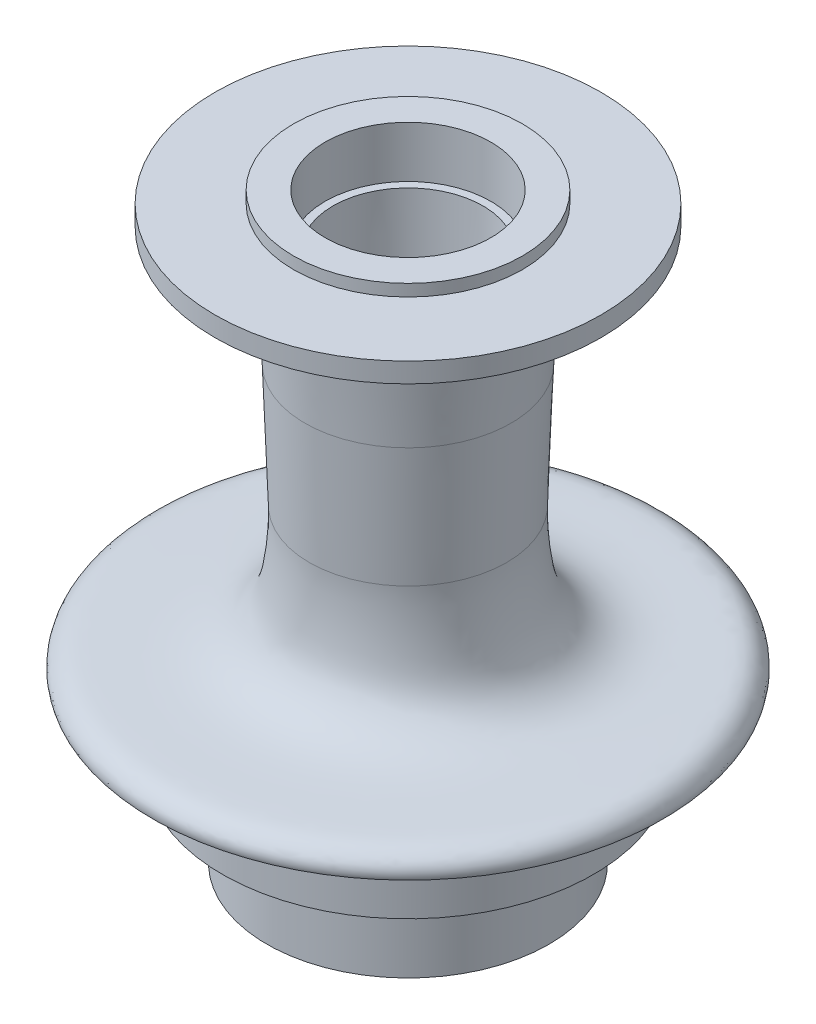
ISO-10303-21;
HEADER;
FILE_DESCRIPTION(('STEP AP214'),'2;1');
FILE_NAME('part.step','',(''),(''),'','','');
FILE_SCHEMA(('AUTOMOTIVE_DESIGN { 1 0 10303 214 1 1 1 1 }'));
ENDSEC;
DATA;
#1=APPLICATION_CONTEXT('core data for automotive mechanical design processes');
#2=APPLICATION_PROTOCOL_DEFINITION('international standard','automotive_design',2000,#1);
#3=PRODUCT_CONTEXT('',#1,'mechanical');
#4=PRODUCT('Part','Part','',(#3));
#5=PRODUCT_RELATED_PRODUCT_CATEGORY('part','',(#4));
#6=PRODUCT_DEFINITION_FORMATION('','',#4);
#7=PRODUCT_DEFINITION_CONTEXT('part definition',#1,'design');
#8=PRODUCT_DEFINITION('design','',#6,#7);
#9=PRODUCT_DEFINITION_SHAPE('','',#8);
#10=(LENGTH_UNIT() NAMED_UNIT(*) SI_UNIT(.MILLI.,.METRE.));
#11=(NAMED_UNIT(*) PLANE_ANGLE_UNIT() SI_UNIT($,.RADIAN.));
#12=(NAMED_UNIT(*) SI_UNIT($,.STERADIAN.) SOLID_ANGLE_UNIT());
#13=UNCERTAINTY_MEASURE_WITH_UNIT(LENGTH_MEASURE(1.E-05),#10,'distance_accuracy_value','');
#14=(GEOMETRIC_REPRESENTATION_CONTEXT(3) GLOBAL_UNCERTAINTY_ASSIGNED_CONTEXT((#13)) GLOBAL_UNIT_ASSIGNED_CONTEXT((#10,
#11,#12)) REPRESENTATION_CONTEXT('',''));
#15=CARTESIAN_POINT('',(0.,0.,0.));
#16=DIRECTION('',(0.,0.,1.));
#17=DIRECTION('',(1.,0.,0.));
#18=AXIS2_PLACEMENT_3D('',#15,#16,#17);
#19=CARTESIAN_POINT('',(1.20729060743416E-13,-59.79986625963,0.));
#20=DIRECTION('',(0.,-1.,0.));
#21=DIRECTION('',(1.,0.,0.));
#22=AXIS2_PLACEMENT_3D('',#19,#20,#21);
#23=CONICAL_SURFACE('',#22,33.4343404918245,0.100930263307096);
#24=CARTESIAN_POINT('',(1.20729060743416E-13,-59.79986625963,0.));
#25=DIRECTION('',(0.,1.,0.));
#26=DIRECTION('',(-1.,0.,0.));
#27=AXIS2_PLACEMENT_3D('',#24,#25,#26);
#28=CIRCLE('',#27,33.4343404918245);
#29=CARTESIAN_POINT('',(9.28218533115908,-59.79986625963,-32.1200273910418));
#30=VERTEX_POINT('',#29);
#31=CARTESIAN_POINT('',(7.1205944149857,-59.79986625963,32.6672964798211));
#32=VERTEX_POINT('',#31);
#33=EDGE_CURVE('E209',#30,#32,#28,.T.);
#34=ORIENTED_EDGE('',*,*,#33,.F.);
#35=CARTESIAN_POINT('',(-19.1687823911382,-99.0073871203538,-32.1200273910418));
#36=CARTESIAN_POINT('',(-18.9027250081955,-97.6613157246267,-32.1200273910418));
#37=CARTESIAN_POINT('',(-18.6328175276927,-96.3159964492487,-32.1200273910418));
#38=CARTESIAN_POINT('',(-18.0840719761221,-93.6271375209407,-32.1200273910418));
#39=CARTESIAN_POINT('',(-17.8052336223954,-92.2835979257411,-32.1200273910418));
#40=CARTESIAN_POINT('',(-17.2368188773369,-89.5958515033702,-32.1200273910418));
#41=CARTESIAN_POINT('',(-16.9472212486299,-88.2516491570557,-32.1200273910418));
#42=CARTESIAN_POINT('',(-16.356234747528,-85.5658523065461,-32.1200273910418));
#43=CARTESIAN_POINT('',(-16.0548460232311,-84.2242577698185,-32.1200273910418));
#44=CARTESIAN_POINT('',(-15.4186602128928,-81.4590478717845,-32.1200273910418));
#45=CARTESIAN_POINT('',(-15.0829573193228,-80.0356401421744,-32.1200273910418));
#46=CARTESIAN_POINT('',(-14.3927360711123,-77.1934052528158,-32.1200273910418));
#47=CARTESIAN_POINT('',(-14.0382180111173,-75.7745780217056,-32.1200273910418));
#48=CARTESIAN_POINT('',(-13.3065457434716,-72.9449267742672,-32.1200273910418));
#49=CARTESIAN_POINT('',(-12.9294252331908,-71.5340941151127,-32.1200273910418));
#50=CARTESIAN_POINT('',(-12.3417074775923,-69.4240344115508,-32.1200273910418));
#51=CARTESIAN_POINT('',(-12.1421348667845,-68.7217331088597,-32.1200273910418));
#52=CARTESIAN_POINT('',(-11.7345504679368,-67.3195868304282,-32.1200273910418));
#53=CARTESIAN_POINT('',(-11.5265387934885,-66.6197418217633,-32.1200273910418));
#54=CARTESIAN_POINT('',(-11.1038760461954,-65.2332247969363,-32.1200273910418));
#55=CARTESIAN_POINT('',(-10.8893664510695,-64.5465097500048,-32.1200273910418));
#56=CARTESIAN_POINT('',(-10.4492594300789,-63.1765911771564,-32.1200273910418));
#57=CARTESIAN_POINT('',(-10.223661432871,-62.4933878341918,-32.1200273910418));
#58=CARTESIAN_POINT('',(-9.758632036217,-61.129491669726,-32.1200273910418));
#59=CARTESIAN_POINT('',(-9.51916265908692,-60.4488117497555,-32.1200273910418));
#60=CARTESIAN_POINT('',(-9.02420985737996,-59.0933884154323,-32.1200273910418));
#61=CARTESIAN_POINT('',(-8.76872903467408,-58.4186440567639,-32.1200273910418));
#62=CARTESIAN_POINT('',(-8.24223957389128,-57.0882102779597,-32.1200273910418));
#63=CARTESIAN_POINT('',(-7.97156113200226,-56.4323907665077,-32.1200273910418));
#64=CARTESIAN_POINT('',(-7.40539573153379,-55.1308598800939,-32.1200273910418));
#65=CARTESIAN_POINT('',(-7.10989224015013,-54.4851555866366,-32.1200273910418));
#66=CARTESIAN_POINT('',(-6.64269896361589,-53.5300752277546,-32.1200273910418));
#67=CARTESIAN_POINT('',(-6.48336284758461,-53.2146548038314,-32.1200273910418));
#68=CARTESIAN_POINT('',(-6.15506884365628,-52.5888774611227,-32.1200273910418));
#69=CARTESIAN_POINT('',(-5.98611204955203,-52.2785199718639,-32.1200273910418));
#70=CARTESIAN_POINT('',(-5.63693512837244,-51.6646764551865,-32.1200273910418));
#71=CARTESIAN_POINT('',(-5.45672894094535,-51.3611825343324,-32.1200273910418));
#72=CARTESIAN_POINT('',(-5.0824824124241,-50.7628973650559,-32.1200273910418));
#73=CARTESIAN_POINT('',(-4.88844692580794,-50.4681031136849,-32.1200273910418));
#74=CARTESIAN_POINT('',(-4.54787480068365,-49.9826723964043,-32.1200273910418));
#75=CARTESIAN_POINT('',(-4.40593803971509,-49.7888155964191,-32.1200273910418));
#76=CARTESIAN_POINT('',(-4.11267050876102,-49.4081396382554,-32.1200273910418));
#77=CARTESIAN_POINT('',(-3.96133520393455,-49.2213239484054,-32.1200273910418));
#78=CARTESIAN_POINT('',(-3.64817680228393,-48.8576034363628,-32.1200273910418));
#79=CARTESIAN_POINT('',(-3.48638686350959,-48.6806703065779,-32.1200273910418));
#80=CARTESIAN_POINT('',(-3.15008856271922,-48.3394408593386,-32.1200273910418));
#81=CARTESIAN_POINT('',(-2.97558956412164,-48.1751354182251,-32.1200273910418));
#82=CARTESIAN_POINT('',(-2.60351405682939,-47.8567867774717,-32.1200273910418));
#83=CARTESIAN_POINT('',(-2.40525553295735,-47.7035276549091,-32.1200273910418));
#84=CARTESIAN_POINT('',(-1.99024247437136,-47.4238261055312,-32.1200273910418));
#85=CARTESIAN_POINT('',(-1.77349578322511,-47.297372385153,-32.1200273910418));
#86=CARTESIAN_POINT('',(-1.36272727752306,-47.102213483968,-32.1200273910418));
#87=CARTESIAN_POINT('',(-1.17176809441563,-47.0271827688717,-32.1200273910418));
#88=CARTESIAN_POINT('',(-0.780125312899384,-46.9097976345264,-32.1200273910418));
#89=CARTESIAN_POINT('',(-0.579460180072017,-46.8673835744369,-32.1200273910418));
#90=CARTESIAN_POINT('',(-0.172173437027227,-46.8202778382634,-32.1200273910418));
#91=CARTESIAN_POINT('',(0.0344798117402685,-46.8158495800599,-32.1200273910418));
#92=CARTESIAN_POINT('',(0.444956821306117,-46.8460599269466,-32.1200273910418));
#93=CARTESIAN_POINT('',(0.64877809415581,-46.8807309249903,-32.1200273910418));
#94=CARTESIAN_POINT('',(1.07505081347502,-46.9917881427812,-32.1200273910418));
#95=CARTESIAN_POINT('',(1.29612521015382,-47.0733269165819,-32.1200273910418));
#96=CARTESIAN_POINT('',(1.72231608842142,-47.2707438090281,-32.1200273910418));
#97=CARTESIAN_POINT('',(1.92739986863018,-47.386690080767,-32.1200273910418));
#98=CARTESIAN_POINT('',(2.29131190464725,-47.6238195280482,-32.1200273910418));
#99=CARTESIAN_POINT('',(2.45244421779674,-47.7415569471767,-32.1200273910418));
#100=CARTESIAN_POINT('',(2.76400766573567,-47.9905441841909,-32.1200273910418));
#101=CARTESIAN_POINT('',(2.91443027474174,-48.1218045684668,-32.1200273910418));
#102=CARTESIAN_POINT('',(3.20599588677176,-48.3948441141838,-32.1200273910418));
#103=CARTESIAN_POINT('',(3.34711530438789,-48.536648206932,-32.1200273910418));
#104=CARTESIAN_POINT('',(3.62083182674354,-48.8281051849082,-32.1200273910418));
#105=CARTESIAN_POINT('',(3.75343177084105,-48.977755424669,-32.1200273910418));
#106=CARTESIAN_POINT('',(4.08440067355935,-49.3698841661066,-32.1200273910418));
#107=CARTESIAN_POINT('',(4.27741661120751,-49.616872092367,-32.1200273910418));
#108=CARTESIAN_POINT('',(4.64885138687969,-50.1216610311098,-32.1200273910418));
#109=CARTESIAN_POINT('',(4.82726171350738,-50.3794682179947,-32.1200273910418));
#110=CARTESIAN_POINT('',(5.17231591239864,-50.9034969440891,-32.1200273910418));
#111=CARTESIAN_POINT('',(5.33893683401745,-51.1697335101978,-32.1200273910418));
#112=CARTESIAN_POINT('',(5.66206315469713,-51.7082844682541,-32.1200273910418));
#113=CARTESIAN_POINT('',(5.81856729316581,-51.9805996119516,-32.1200273910418));
#114=CARTESIAN_POINT('',(6.12387490311396,-52.5315581066756,-32.1200273910418));
#115=CARTESIAN_POINT('',(6.27262850010436,-52.8102289825684,-32.1200273910418));
#116=CARTESIAN_POINT('',(6.56269939011301,-53.3714162849132,-32.1200273910418));
#117=CARTESIAN_POINT('',(6.70401635294637,-53.6539328814145,-32.1200273910418));
#118=CARTESIAN_POINT('',(6.98001477395537,-54.2217180763887,-32.1200273910418));
#119=CARTESIAN_POINT('',(7.1147047766222,-54.5069825321598,-32.1200273910418));
#120=CARTESIAN_POINT('',(7.37843085595563,-55.0800928401456,-32.1200273910418));
#121=CARTESIAN_POINT('',(7.50746712389514,-55.3679386046339,-32.1200273910418));
#122=CARTESIAN_POINT('',(7.92518583577531,-56.3216134156553,-32.1200273910418));
#123=CARTESIAN_POINT('',(8.2032204053256,-56.992115745607,-32.1200273910418));
#124=CARTESIAN_POINT('',(8.73897037937569,-58.3412260562856,-32.1200273910418));
#125=CARTESIAN_POINT('',(8.99668233307952,-59.0198353911587,-32.1200273910418));
#126=CARTESIAN_POINT('',(9.49587501542453,-60.3833862341983,-32.1200273910418));
#127=CARTESIAN_POINT('',(9.73734703512209,-61.0683309193559,-32.1200273910418));
#128=CARTESIAN_POINT('',(10.2068193839069,-62.4428262988265,-32.1200273910418));
#129=CARTESIAN_POINT('',(10.4348192521454,-63.1323771498078,-32.1200273910418));
#130=CARTESIAN_POINT('',(10.880007027108,-64.516680592312,-32.1200273910418));
#131=CARTESIAN_POINT('',(11.0971691670768,-65.2114414471084,-32.1200273910418));
#132=CARTESIAN_POINT('',(11.5217822790494,-66.603924765007,-32.1200273910418));
#133=CARTESIAN_POINT('',(11.7292331192117,-67.3016472681767,-32.1200273910418));
#134=CARTESIAN_POINT('',(12.3389162901079,-69.3979965434657,-32.1200273910418));
#135=CARTESIAN_POINT('',(12.7286261650622,-70.8002685531618,-32.1200273910418));
#136=CARTESIAN_POINT('',(13.4818367598874,-73.6100627086698,-32.1200273910418));
#137=CARTESIAN_POINT('',(13.8453667347833,-75.0175770859155,-32.1200273910418));
#138=CARTESIAN_POINT('',(14.5518148256759,-77.8378647027661,-32.1200273910418));
#139=CARTESIAN_POINT('',(14.8947314065071,-79.2506383257491,-32.1200273910418));
#140=CARTESIAN_POINT('',(15.5632328107012,-82.0786033501802,-32.1200273910418));
#141=CARTESIAN_POINT('',(15.888836510607,-83.4937903068163,-32.1200273910418));
#142=CARTESIAN_POINT('',(16.5258521682623,-86.3273553854903,-32.1200273910418));
#143=CARTESIAN_POINT('',(16.8372640583749,-87.7457335227031,-32.1200273910418));
#144=CARTESIAN_POINT('',(17.3188362693838,-89.9846756612072,-32.1200273910418));
#145=CARTESIAN_POINT('',(17.4930352624526,-90.8043747256982,-32.1200273910418));
#146=CARTESIAN_POINT('',(17.837755509206,-92.4446932181736,-32.1200273910418));
#147=CARTESIAN_POINT('',(18.0082761259929,-93.2653127800693,-32.1200273910418));
#148=CARTESIAN_POINT('',(18.3456221573824,-94.9058829923058,-32.1200273910418));
#149=CARTESIAN_POINT('',(18.5124532638145,-95.7258324734838,-32.1200273910418));
#150=CARTESIAN_POINT('',(18.8429336902099,-97.3662218198634,-32.1200273910418));
#151=CARTESIAN_POINT('',(19.006583567102,-98.1866615728339,-32.1200273910418));
#152=CARTESIAN_POINT('',(19.1687823911384,-99.0073871203538,-32.1200273910418));
#153=B_SPLINE_CURVE_WITH_KNOTS('',3,(#35,#36,#37,#38,#39,#40,#41,#42,#43,#44,#45,#46,#47,#48,
#49,#50,#51,#52,#53,#54,#55,#56,#57,#58,#59,#60,#61,#62,#63,#64,#65,#66,#67,#68,#69,#70,#71,#72,
#73,#74,#75,#76,#77,#78,#79,#80,#81,#82,#83,#84,#85,#86,#87,#88,#89,#90,#91,#92,#93,#94,#95,#96,
#97,#98,#99,#100,#101,#102,#103,#104,#105,#106,#107,#108,#109,#110,#111,#112,#113,#114,#115,
#116,#117,#118,#119,#120,#121,#122,#123,#124,#125,#126,#127,#128,#129,#130,#131,#132,#133,#134,
#135,#136,#137,#138,#139,#140,#141,#142,#143,#144,#145,#146,#147,#148,#149,#150,#151,#152),
.UNSPECIFIED.,.F.,.F.,(4,2,2,2,2,2,2,2,2,2,2,2,2,2,2,2,2,2,2,2,2,2,2,2,2,2,2,2,2,2,2,2,2,2,2,2,
2,2,2,2,2,2,2,2,2,2,2,2,2,2,2,2,2,2,2,2,2,2,4),(0.,4.11634696256925,8.23282433500074,
12.3579106800695,16.4829452300432,20.8702137043421,25.2574134943103,29.6382278229822,
31.828507282608,34.0187572704136,36.1769946905972,38.3353434333594,40.4999097161711,
42.6641251629401,44.7922314415617,46.9217663898789,47.981781164926,49.0416756646163,
50.1002819130714,51.1585183735992,51.8790835935287,52.599999232162,53.3187310877087,
54.0369386711481,54.7871653785026,55.5370753718261,56.1502478632308,56.7622964608357,
57.3785859933136,57.9953864847081,58.6983844322072,59.4027842535299,60.0006222400047,
60.5989309517598,61.1987023814176,61.798272871968,62.7379034793456,63.6780778138633,
64.6200347260975,65.5621087846332,66.5096415086385,67.4572162674514,68.4035354069045,
69.3498225064404,71.5269100428149,73.7043664578942,75.8829814108125,78.0616708456281,
80.245314868478,82.4289885281047,86.7948776887979,91.1558098985505,95.5170664837689,
99.8734660708395,104.229886417943,106.743893118169,109.258331671294,111.768574002477,
114.278372841211),.UNSPECIFIED.);
#154=CARTESIAN_POINT('',(0.,-46.8221221149622,-32.1200273910416));
#155=VERTEX_POINT('',#154);
#156=EDGE_CURVE('E94',#155,#30,#153,.T.);
#157=ORIENTED_EDGE('',*,*,#156,.F.);
#158=DIRECTION('',(0.,-0.994910863393885,-0.100758989181283));
#159=VECTOR('',#158,1.);
#160=CARTESIAN_POINT('',(0.,270.336321449422,0.));
#161=LINE('',#160,#159);
#162=CARTESIAN_POINT('',(0.,-39.3216123069004,-31.3604178477035));
#163=VERTEX_POINT('',#162);
#164=EDGE_CURVE('E108',#155,#163,#161,.F.);
#165=ORIENTED_EDGE('',*,*,#164,.T.);
#166=CARTESIAN_POINT('',(1.18221197927883E-13,-39.3216123069003,0.));
#167=DIRECTION('',(0.,1.,0.));
#168=DIRECTION('',(-1.,0.,0.));
#169=AXIS2_PLACEMENT_3D('',#166,#167,#168);
#170=CIRCLE('',#169,31.3604178477035);
#171=CARTESIAN_POINT('',(0.,-39.3216123069004,31.3604178477035));
#172=VERTEX_POINT('',#171);
#173=EDGE_CURVE('E107',#163,#172,#170,.T.);
#174=ORIENTED_EDGE('',*,*,#173,.T.);
#175=DIRECTION('',(0.,0.994910863393885,-0.100758989181283));
#176=VECTOR('',#175,1.);
#177=CARTESIAN_POINT('',(0.,270.336321449422,0.));
#178=LINE('',#177,#176);
#179=CARTESIAN_POINT('',(0.,-52.2259472828284,32.6672964798211));
#180=VERTEX_POINT('',#179);
#181=EDGE_CURVE('E98',#172,#180,#178,.F.);
#182=ORIENTED_EDGE('',*,*,#181,.T.);
#183=CARTESIAN_POINT('',(18.2204862355415,-99.0073871203538,32.6672964798211));
#184=CARTESIAN_POINT('',(17.9365645439715,-97.6421130060116,32.6672964798211));
#185=CARTESIAN_POINT('',(17.6479204730695,-96.2778050145036,32.6672964798211));
#186=CARTESIAN_POINT('',(17.0594264957987,-93.5515128990658,32.6672964798211));
#187=CARTESIAN_POINT('',(16.7595758246666,-92.1895289403893,32.6672964798211));
#188=CARTESIAN_POINT('',(16.1461981416955,-89.4651420010152,32.6672964798211));
#189=CARTESIAN_POINT('',(15.8326395301969,-88.1027461140478,32.6672964798211));
#190=CARTESIAN_POINT('',(15.1901636502384,-85.3816159791651,32.6672964798211));
#191=CARTESIAN_POINT('',(14.8612468812954,-84.0228816136789,32.6672964798211));
#192=CARTESIAN_POINT('',(14.1743772873109,-81.2676506623893,32.6672964798211));
#193=CARTESIAN_POINT('',(13.8158385071233,-79.871299708964,32.6672964798211));
#194=CARTESIAN_POINT('',(13.0744310584008,-77.0848865107695,32.6672964798211));
#195=CARTESIAN_POINT('',(12.6915602837275,-75.6948248215748,32.6672964798211));
#196=CARTESIAN_POINT('',(12.0941063672266,-73.61716723586,32.6672964798211));
#197=CARTESIAN_POINT('',(11.8912075069017,-72.9262076804606,32.6672964798211));
#198=CARTESIAN_POINT('',(11.476450463489,-71.5469873707747,32.6672964798211));
#199=CARTESIAN_POINT('',(11.2645924383988,-70.8587265691285,32.6672964798211));
#200=CARTESIAN_POINT('',(10.830507583282,-69.4855944579558,32.6672964798211));
#201=CARTESIAN_POINT('',(10.6082823809465,-68.8007226348963,32.6672964798211));
#202=CARTESIAN_POINT('',(10.1515806190166,-67.4350887114456,32.6672964798211));
#203=CARTESIAN_POINT('',(9.91710463196999,-66.7543264206487,32.6672964798211));
#204=CARTESIAN_POINT('',(9.55577955015942,-65.7411579365879,32.6672964798211));
#205=CARTESIAN_POINT('',(9.43449811658734,-65.4067637090459,32.6672964798211));
#206=CARTESIAN_POINT('',(9.18795021119091,-64.7394485658228,32.6672964798211));
#207=CARTESIAN_POINT('',(9.0626837327475,-64.4065276525899,32.6672964798211));
#208=CARTESIAN_POINT('',(8.68022496945542,-63.4101364776055,32.6672964798211));
#209=CARTESIAN_POINT('',(8.41642169907464,-62.7491744370488,32.6672964798211));
#210=CARTESIAN_POINT('',(7.86796615875134,-61.4395318644003,32.6672964798211));
#211=CARTESIAN_POINT('',(7.58341674016472,-60.7908084624997,32.6672964798211));
#212=CARTESIAN_POINT('',(6.98595112688768,-59.5066433332103,32.6672964798211));
#213=CARTESIAN_POINT('',(6.67304642269678,-58.8711963530991,32.6672964798211));
#214=CARTESIAN_POINT('',(6.10756088732584,-57.8073681085897,32.6672964798211));
#215=CARTESIAN_POINT('',(5.86483388414459,-57.3737702318446,32.6672964798211));
#216=CARTESIAN_POINT('',(5.35391472137835,-56.5198098813093,32.6672964798211));
#217=CARTESIAN_POINT('',(5.08565022826718,-56.0994897813387,32.6672964798211));
#218=CARTESIAN_POINT('',(4.64379816024079,-55.4652130891882,32.6672964798211));
#219=CARTESIAN_POINT('',(4.48171594239009,-55.2432577532141,32.6672964798211));
#220=CARTESIAN_POINT('',(4.1455403617956,-54.8086842228904,32.6672964798211));
#221=CARTESIAN_POINT('',(3.97145173984888,-54.5960623968095,32.6672964798211));
#222=CARTESIAN_POINT('',(3.60947084471071,-54.1841271592314,32.6672964798211));
#223=CARTESIAN_POINT('',(3.42163001981636,-53.9847689853134,32.6672964798211));
#224=CARTESIAN_POINT('',(3.02892716903163,-53.6037833455141,32.6672964798211));
#225=CARTESIAN_POINT('',(2.82408814542604,-53.4221326192032,32.6672964798211));
#226=CARTESIAN_POINT('',(2.42762646560854,-53.1104732139896,32.6672964798211));
#227=CARTESIAN_POINT('',(2.23890396530387,-52.9768267724604,32.6672964798211));
#228=CARTESIAN_POINT('',(1.84566965139605,-52.7345641163326,32.6672964798211));
#229=CARTESIAN_POINT('',(1.64115773956502,-52.6259480574679,32.6672964798211));
#230=CARTESIAN_POINT('',(1.21389131173003,-52.4416149560339,32.6672964798211));
#231=CARTESIAN_POINT('',(0.990919971415094,-52.3663841408591,32.6672964798211));
#232=CARTESIAN_POINT('',(0.534633920307613,-52.261352473011,32.6672964798211));
#233=CARTESIAN_POINT('',(0.301346506664215,-52.2314383381007,32.6672964798211));
#234=CARTESIAN_POINT('',(-0.13722122147202,-52.2224315371714,32.6672964798211));
#235=CARTESIAN_POINT('',(-0.342394441438274,-52.237507244526,32.6672964798211));
#236=CARTESIAN_POINT('',(-0.746847696758637,-52.3040363799537,32.6672964798211));
#237=CARTESIAN_POINT('',(-0.946118915133741,-52.3555416300307,32.6672964798211));
#238=CARTESIAN_POINT('',(-1.3877100866107,-52.5075908588362,32.6672964798211));
#239=CARTESIAN_POINT('',(-1.62664632377097,-52.6177721928351,32.6672964798211));
#240=CARTESIAN_POINT('',(-2.08427025389067,-52.8738981057522,32.6672964798211));
#241=CARTESIAN_POINT('',(-2.3029187594557,-53.0199099908074,32.6672964798211));
#242=CARTESIAN_POINT('',(-2.7038198363898,-53.3234371729684,32.6672964798211));
#243=CARTESIAN_POINT('',(-2.88758698572342,-53.4789960595785,32.6672964798211));
#244=CARTESIAN_POINT('',(-3.24132524846001,-53.8052143485377,32.6672964798211));
#245=CARTESIAN_POINT('',(-3.41128339769552,-53.9758876335415,32.6672964798211));
#246=CARTESIAN_POINT('',(-3.73980595614313,-54.3288088542543,32.6672964798211));
#247=CARTESIAN_POINT('',(-3.8983311072092,-54.5110929672852,32.6672964798211));
#248=CARTESIAN_POINT('',(-4.20506797972361,-54.8839196189576,32.6672964798211));
#249=CARTESIAN_POINT('',(-4.3532847626005,-55.0744580290659,32.6672964798211));
#250=CARTESIAN_POINT('',(-4.80193188920108,-55.6785040024359,32.6672964798211));
#251=CARTESIAN_POINT('',(-5.08731448110098,-56.1031747040079,32.6672964798211));
#252=CARTESIAN_POINT('',(-5.62979205503104,-56.9703604801979,32.6672964798211));
#253=CARTESIAN_POINT('',(-5.88685832002206,-57.4128930593343,32.6672964798211));
#254=CARTESIAN_POINT('',(-6.37989070907966,-58.3111949169257,32.6672964798211));
#255=CARTESIAN_POINT('',(-6.61579188286438,-58.7669996120183,32.6672964798211));
#256=CARTESIAN_POINT('',(-7.07030228155585,-59.687166500961,32.6672964798211));
#257=CARTESIAN_POINT('',(-7.2889086635727,-60.1515300863038,32.6672964798211));
#258=CARTESIAN_POINT('',(-7.71482281967817,-61.0926559268465,32.6672964798211));
#259=CARTESIAN_POINT('',(-7.92194694138113,-61.5695008839274,32.6672964798211));
#260=CARTESIAN_POINT('',(-8.32429509539556,-62.5282123339614,32.6672964798211));
#261=CARTESIAN_POINT('',(-8.51951805422505,-63.0100792753195,32.6672964798211));
#262=CARTESIAN_POINT('',(-8.89953342706446,-63.9767584033648,32.6672964798211));
#263=CARTESIAN_POINT('',(-9.08434635189236,-64.4615625534886,32.6672964798211));
#264=CARTESIAN_POINT('',(-9.44540301492457,-65.4343237543759,32.6672964798211));
#265=CARTESIAN_POINT('',(-9.62164702455126,-65.9222807047184,32.6672964798211));
#266=CARTESIAN_POINT('',(-10.0358658552849,-67.096873748061,32.6672964798211));
#267=CARTESIAN_POINT('',(-10.2702752901954,-67.7847664715277,32.6672964798211));
#268=CARTESIAN_POINT('',(-10.726981057304,-69.1645729222028,32.6672964798211));
#269=CARTESIAN_POINT('',(-10.9492768968792,-69.8564868116753,32.6672964798211));
#270=CARTESIAN_POINT('',(-11.3836046023854,-71.2436335318009,32.6672964798211));
#271=CARTESIAN_POINT('',(-11.5956349519219,-71.9388668362274,32.6672964798211));
#272=CARTESIAN_POINT('',(-12.0108162698175,-73.3319841336533,32.6672964798211));
#273=CARTESIAN_POINT('',(-12.2139670900645,-74.0298681706566,32.6672964798211));
#274=CARTESIAN_POINT('',(-12.812522048889,-76.1291439685569,32.6672964798211));
#275=CARTESIAN_POINT('',(-13.1963147689698,-77.5338500647133,32.6672964798211));
#276=CARTESIAN_POINT('',(-13.9396983137381,-80.3494754612376,32.6672964798211));
#277=CARTESIAN_POINT('',(-14.299291108111,-81.7603942459577,32.6672964798211));
#278=CARTESIAN_POINT('',(-14.9745708071023,-84.4887238125941,32.6672964798211));
#279=CARTESIAN_POINT('',(-15.2915717776644,-85.8058103975932,32.6672964798211));
#280=CARTESIAN_POINT('',(-15.9113802580448,-88.4433487998527,32.6672964798211));
#281=CARTESIAN_POINT('',(-16.2141873710506,-89.7638007101095,32.6672964798211));
#282=CARTESIAN_POINT('',(-16.8068509421605,-92.4035423261033,32.6672964798211));
#283=CARTESIAN_POINT('',(-17.0967426996678,-93.7228241284535,32.6672964798211));
#284=CARTESIAN_POINT('',(-17.6660642104311,-96.3635633246228,32.6672964798211));
#285=CARTESIAN_POINT('',(-17.9454945844156,-97.685020584488,32.6672964798211));
#286=CARTESIAN_POINT('',(-18.2204862355413,-99.0073871203538,32.6672964798211));
#287=B_SPLINE_CURVE_WITH_KNOTS('',3,(#183,#184,#185,#186,#187,#188,#189,#190,#191,#192,#193,
#194,#195,#196,#197,#198,#199,#200,#201,#202,#203,#204,#205,#206,#207,#208,#209,#210,#211,#212,
#213,#214,#215,#216,#217,#218,#219,#220,#221,#222,#223,#224,#225,#226,#227,#228,#229,#230,#231,
#232,#233,#234,#235,#236,#237,#238,#239,#240,#241,#242,#243,#244,#245,#246,#247,#248,#249,#250,
#251,#252,#253,#254,#255,#256,#257,#258,#259,#260,#261,#262,#263,#264,#265,#266,#267,#268,#269,
#270,#271,#272,#273,#274,#275,#276,#277,#278,#279,#280,#281,#282,#283,#284,#285,#286),
.UNSPECIFIED.,.F.,.F.,(4,2,2,2,2,2,2,2,2,2,2,2,2,2,2,2,2,2,2,2,2,2,2,2,2,2,2,2,2,2,2,2,2,2,2,2,
2,2,2,2,2,2,2,2,2,2,2,2,2,2,2,4),(0.,4.18346618543643,8.36721838300408,12.5611839303778,
16.7550131658524,21.0797939044881,25.4049495004227,27.5653040201477,29.7256204572373,
31.8855988494593,34.0454763839438,35.1125795840431,36.179684556669,38.314329250245,
40.4390295794728,42.5628727275493,44.0530848180555,45.54765110767,46.3718435094889,
47.1957123171372,48.0166426224854,48.8364795998435,49.5287955241858,50.2211157558585,
50.9232122811054,51.6235507985826,52.2372131207877,52.8517501544115,53.6366811084194,
54.4230979621197,55.1443357438237,55.8662429968721,56.590521464427,57.314441761888,
58.8475546421691,60.382208287491,61.9214208923411,63.4608859870312,65.0203483530054,
66.5799511746114,68.1363651296355,69.692729752723,71.8727903121357,74.0529394618942,
76.2334096817771,78.4139162584523,82.7821791907409,87.1500861494013,91.2140871037467,
95.2782016062151,99.3304251411594,103.382407854198),.UNSPECIFIED.);
#288=EDGE_CURVE('E86',#32,#180,#287,.T.);
#289=ORIENTED_EDGE('',*,*,#288,.F.);
#290=EDGE_LOOP('',(#34,#157,#165,#174,#182,#289));
#291=FACE_BOUND('',#290,.T.);
#292=ADVANCED_FACE('F39',(#291),#23,.F.);
#293=CARTESIAN_POINT('',(0.,926.027727683969,0.));
#294=DIRECTION('',(0.,1.,0.));
#295=DIRECTION('',(-1.,0.,0.));
#296=AXIS2_PLACEMENT_3D('',#293,#294,#295);
#297=CYLINDRICAL_SURFACE('',#296,47.);
#298=CARTESIAN_POINT('',(1.15608462837053E-13,-17.987011239481,0.));
#299=DIRECTION('',(0.,1.,0.));
#300=DIRECTION('',(-1.,0.,0.));
#301=AXIS2_PLACEMENT_3D('',#298,#299,#300);
#302=CIRCLE('',#301,47.);
#303=CARTESIAN_POINT('',(-46.9999999999999,-17.987011239481,0.));
#304=VERTEX_POINT('',#303);
#305=EDGE_CURVE('E102',#304,#304,#302,.T.);
#306=ORIENTED_EDGE('',*,*,#305,.F.);
#307=EDGE_LOOP('',(#306));
#308=FACE_BOUND('',#307,.T.);
#309=CARTESIAN_POINT('',(1.18164665680265E-13,-38.8599914733933,0.));
#310=DIRECTION('',(0.,1.,0.));
#311=DIRECTION('',(-1.,0.,0.));
#312=AXIS2_PLACEMENT_3D('',#309,#310,#311);
#313=CIRCLE('',#312,47.);
#314=CARTESIAN_POINT('',(-46.9999999999999,-38.8599914733933,0.));
#315=VERTEX_POINT('',#314);
#316=EDGE_CURVE('E11',#315,#315,#313,.T.);
#317=ORIENTED_EDGE('',*,*,#316,.T.);
#318=EDGE_LOOP('',(#317));
#319=FACE_BOUND('',#318,.T.);
#320=ADVANCED_FACE('F41',(#308,#319),#297,.T.);
#321=CARTESIAN_POINT('',(35.7500000000001,-38.8599914733933,0.));
#322=DIRECTION('',(0.,1.,0.));
#323=DIRECTION('',(-1.,0.,0.));
#324=AXIS2_PLACEMENT_3D('',#321,#322,#323);
#325=PLANE('',#324);
#326=ORIENTED_EDGE('',*,*,#316,.F.);
#327=EDGE_LOOP('',(#326));
#328=FACE_BOUND('',#327,.T.);
#329=CARTESIAN_POINT('',(1.18164665680265E-13,-38.8599914733933,0.));
#330=DIRECTION('',(0.,1.,0.));
#331=DIRECTION('',(-1.,0.,0.));
#332=AXIS2_PLACEMENT_3D('',#329,#330,#331);
#333=CIRCLE('',#332,35.75);
#334=CARTESIAN_POINT('',(-35.7499999999999,-38.8599914733933,0.));
#335=VERTEX_POINT('',#334);
#336=EDGE_CURVE('E47',#335,#335,#333,.T.);
#337=ORIENTED_EDGE('',*,*,#336,.T.);
#338=EDGE_LOOP('',(#337));
#339=FACE_BOUND('',#338,.T.);
#340=ADVANCED_FACE('F195',(#328,#339),#325,.F.);
#341=CARTESIAN_POINT('',(0.,926.027727683969,0.));
#342=DIRECTION('',(0.,1.,0.));
#343=DIRECTION('',(-1.,0.,0.));
#344=AXIS2_PLACEMENT_3D('',#341,#342,#343);
#345=CYLINDRICAL_SURFACE('',#344,35.75);
#346=ORIENTED_EDGE('',*,*,#336,.F.);
#347=EDGE_LOOP('',(#346));
#348=FACE_BOUND('',#347,.T.);
#349=CARTESIAN_POINT('',(1.20729060743416E-13,-59.79986625963,0.));
#350=DIRECTION('',(0.,1.,0.));
#351=DIRECTION('',(-1.,0.,0.));
#352=AXIS2_PLACEMENT_3D('',#349,#350,#351);
#353=CIRCLE('',#352,35.75);
#354=CARTESIAN_POINT('',(-35.7499999999999,-59.79986625963,0.));
#355=VERTEX_POINT('',#354);
#356=EDGE_CURVE('E207',#355,#355,#353,.T.);
#357=ORIENTED_EDGE('',*,*,#356,.T.);
#358=EDGE_LOOP('',(#357));
#359=FACE_BOUND('',#358,.T.);
#360=ADVANCED_FACE('F193',(#348,#359),#345,.T.);
#361=CARTESIAN_POINT('',(35.7500000000001,-59.79986625963,0.));
#362=DIRECTION('',(0.,-1.,0.));
#363=DIRECTION('',(1.,0.,0.));
#364=AXIS2_PLACEMENT_3D('',#361,#362,#363);
#365=PLANE('',#364);
#366=ORIENTED_EDGE('',*,*,#33,.T.);
#367=DIRECTION('',(-1.,0.,0.));
#368=VECTOR('',#367,1.);
#369=CARTESIAN_POINT('',(64.7226760521992,-59.79986625963,32.6672964798211));
#370=LINE('',#369,#368);
#371=CARTESIAN_POINT('',(0.,-59.79986625963,32.6672964798211));
#372=VERTEX_POINT('',#371);
#373=EDGE_CURVE('E62',#32,#372,#370,.T.);
#374=ORIENTED_EDGE('',*,*,#373,.T.);
#375=DIRECTION('',(0.,0.,-1.));
#376=VECTOR('',#375,1.);
#377=CARTESIAN_POINT('',(0.,-59.79986625963,32.6672964798211));
#378=LINE('',#377,#376);
#379=CARTESIAN_POINT('',(0.,-59.79986625963,-32.1200273910418));
#380=VERTEX_POINT('',#379);
#381=EDGE_CURVE('E101',#372,#380,#378,.T.);
#382=ORIENTED_EDGE('',*,*,#381,.T.);
#383=DIRECTION('',(-1.,0.,0.));
#384=VECTOR('',#383,1.);
#385=CARTESIAN_POINT('',(64.7226760521992,-59.79986625963,-32.1200273910418));
#386=LINE('',#385,#384);
#387=EDGE_CURVE('E301',#30,#380,#386,.T.);
#388=ORIENTED_EDGE('',*,*,#387,.F.);
#389=EDGE_LOOP('',(#366,#374,#382,#388));
#390=FACE_BOUND('',#389,.T.);
#391=ORIENTED_EDGE('',*,*,#356,.F.);
#392=EDGE_LOOP('',(#391));
#393=FACE_BOUND('',#392,.T.);
#394=ADVANCED_FACE('F187',(#390,#393),#365,.T.);
#395=CARTESIAN_POINT('',(0.,926.027727683969,0.));
#396=DIRECTION('',(0.,1.,0.));
#397=DIRECTION('',(-1.,0.,0.));
#398=AXIS2_PLACEMENT_3D('',#395,#396,#397);
#399=CYLINDRICAL_SURFACE('',#398,31.3604178477035);
#400=CARTESIAN_POINT('',(1.18164665680265E-13,-38.8599914733933,0.));
#401=DIRECTION('',(0.,-1.,0.));
#402=DIRECTION('',(0.,0.,-1.));
#403=AXIS2_PLACEMENT_3D('',#400,#401,#402);
#404=CIRCLE('',#403,31.3604178477035);
#405=CARTESIAN_POINT('',(1.18164665680265E-13,-38.8599914733933,-31.3604178477035));
#406=VERTEX_POINT('',#405);
#407=CARTESIAN_POINT('',(0.,-38.8599914733933,31.3604178477035));
#408=VERTEX_POINT('',#407);
#409=EDGE_CURVE('E95',#406,#408,#404,.T.);
#410=ORIENTED_EDGE('',*,*,#409,.T.);
#411=DIRECTION('',(0.,1.,0.));
#412=VECTOR('',#411,1.);
#413=CARTESIAN_POINT('',(0.,926.027727683969,31.3604178477035));
#414=LINE('',#413,#412);
#415=EDGE_CURVE('E295',#172,#408,#414,.T.);
#416=ORIENTED_EDGE('',*,*,#415,.F.);
#417=ORIENTED_EDGE('',*,*,#173,.F.);
#418=DIRECTION('',(0.,1.,0.));
#419=VECTOR('',#418,1.);
#420=CARTESIAN_POINT('',(0.,926.027727683969,-31.3604178477035));
#421=LINE('',#420,#419);
#422=EDGE_CURVE('E291',#406,#163,#421,.F.);
#423=ORIENTED_EDGE('',*,*,#422,.F.);
#424=EDGE_LOOP('',(#410,#416,#417,#423));
#425=FACE_BOUND('',#424,.T.);
#426=CARTESIAN_POINT('',(1.17628339858018E-13,-34.4805587861847,0.));
#427=DIRECTION('',(0.,1.,0.));
#428=DIRECTION('',(-1.,0.,0.));
#429=AXIS2_PLACEMENT_3D('',#426,#427,#428);
#430=CIRCLE('',#429,31.3604178477035);
#431=CARTESIAN_POINT('',(-31.3604178477033,-34.4805587861847,0.));
#432=VERTEX_POINT('',#431);
#433=EDGE_CURVE('E214',#432,#432,#430,.T.);
#434=ORIENTED_EDGE('',*,*,#433,.T.);
#435=EDGE_LOOP('',(#434));
#436=FACE_BOUND('',#435,.T.);
#437=ADVANCED_FACE('F183',(#425,#436),#399,.F.);
#438=CARTESIAN_POINT('',(17.5000000000001,-34.4805587861847,0.));
#439=DIRECTION('',(0.,1.,0.));
#440=DIRECTION('',(-1.,0.,0.));
#441=AXIS2_PLACEMENT_3D('',#438,#439,#440);
#442=PLANE('',#441);
#443=ORIENTED_EDGE('',*,*,#433,.F.);
#444=EDGE_LOOP('',(#443));
#445=FACE_BOUND('',#444,.T.);
#446=CARTESIAN_POINT('',(1.17628339858018E-13,-34.4805587861847,0.));
#447=DIRECTION('',(0.,1.,0.));
#448=DIRECTION('',(-1.,0.,0.));
#449=AXIS2_PLACEMENT_3D('',#446,#447,#448);
#450=CIRCLE('',#449,17.5);
#451=CARTESIAN_POINT('',(-17.4999999999999,-34.4805587861847,0.));
#452=VERTEX_POINT('',#451);
#453=EDGE_CURVE('E217',#452,#452,#450,.T.);
#454=ORIENTED_EDGE('',*,*,#453,.T.);
#455=EDGE_LOOP('',(#454));
#456=FACE_BOUND('',#455,.T.);
#457=ADVANCED_FACE('F179',(#445,#456),#442,.F.);
#458=CARTESIAN_POINT('',(0.,926.027727683969,0.));
#459=DIRECTION('',(0.,1.,0.));
#460=DIRECTION('',(-1.,0.,0.));
#461=AXIS2_PLACEMENT_3D('',#458,#459,#460);
#462=CYLINDRICAL_SURFACE('',#461,17.5);
#463=ORIENTED_EDGE('',*,*,#453,.F.);
#464=EDGE_LOOP('',(#463));
#465=FACE_BOUND('',#464,.T.);
#466=CARTESIAN_POINT('',(1.16281228378956E-13,-23.4805587861847,0.));
#467=DIRECTION('',(0.,1.,0.));
#468=DIRECTION('',(-1.,0.,0.));
#469=AXIS2_PLACEMENT_3D('',#466,#467,#468);
#470=CIRCLE('',#469,17.5);
#471=CARTESIAN_POINT('',(-17.4999999999999,-23.4805587861847,0.));
#472=VERTEX_POINT('',#471);
#473=EDGE_CURVE('E220',#472,#472,#470,.T.);
#474=ORIENTED_EDGE('',*,*,#473,.T.);
#475=EDGE_LOOP('',(#474));
#476=FACE_BOUND('',#475,.T.);
#477=ADVANCED_FACE('F175',(#465,#476),#462,.F.);
#478=CARTESIAN_POINT('',(15.5000000000001,-23.4805587861847,0.));
#479=DIRECTION('',(0.,1.,0.));
#480=DIRECTION('',(-1.,0.,0.));
#481=AXIS2_PLACEMENT_3D('',#478,#479,#480);
#482=PLANE('',#481);
#483=ORIENTED_EDGE('',*,*,#473,.F.);
#484=EDGE_LOOP('',(#483));
#485=FACE_BOUND('',#484,.T.);
#486=CARTESIAN_POINT('',(1.16281228378956E-13,-23.4805587861847,0.));
#487=DIRECTION('',(0.,1.,0.));
#488=DIRECTION('',(-1.,0.,0.));
#489=AXIS2_PLACEMENT_3D('',#486,#487,#488);
#490=CIRCLE('',#489,15.5);
#491=CARTESIAN_POINT('',(-15.4999999999999,-23.4805587861847,0.));
#492=VERTEX_POINT('',#491);
#493=EDGE_CURVE('E223',#492,#492,#490,.T.);
#494=ORIENTED_EDGE('',*,*,#493,.T.);
#495=EDGE_LOOP('',(#494));
#496=FACE_BOUND('',#495,.T.);
#497=ADVANCED_FACE('F171',(#485,#496),#482,.F.);
#498=CARTESIAN_POINT('',(1.04243210417048E-13,74.8173175508102,0.));
#499=DIRECTION('',(0.,1.,0.));
#500=DIRECTION('',(-1.,0.,0.));
#501=AXIS2_PLACEMENT_3D('',#498,#499,#500);
#502=CONICAL_SURFACE('',#501,19.,0.0355910235748246);
#503=ORIENTED_EDGE('',*,*,#493,.F.);
#504=EDGE_LOOP('',(#503));
#505=FACE_BOUND('',#504,.T.);
#506=CARTESIAN_POINT('',(1.04243210417048E-13,74.8173175508102,0.));
#507=DIRECTION('',(0.,1.,0.));
#508=DIRECTION('',(-1.,0.,0.));
#509=AXIS2_PLACEMENT_3D('',#506,#507,#508);
#510=CIRCLE('',#509,19.);
#511=CARTESIAN_POINT('',(-18.9999999999999,74.8173175508102,0.));
#512=VERTEX_POINT('',#511);
#513=EDGE_CURVE('E226',#512,#512,#510,.T.);
#514=ORIENTED_EDGE('',*,*,#513,.T.);
#515=EDGE_LOOP('',(#514));
#516=FACE_BOUND('',#515,.T.);
#517=ADVANCED_FACE('F167',(#505,#516),#502,.F.);
#518=CARTESIAN_POINT('',(19.0000000000001,74.8173175508103,0.));
#519=DIRECTION('',(0.,1.,0.));
#520=DIRECTION('',(-1.,0.,0.));
#521=AXIS2_PLACEMENT_3D('',#518,#519,#520);
#522=PLANE('',#521);
#523=CARTESIAN_POINT('',(1.04243210417048E-13,74.8173175508102,0.));
#524=DIRECTION('',(0.,1.,0.));
#525=DIRECTION('',(-1.,0.,0.));
#526=AXIS2_PLACEMENT_3D('',#523,#524,#525);
#527=CIRCLE('',#526,21.);
#528=CARTESIAN_POINT('',(-20.9999999999999,74.8173175508102,0.));
#529=VERTEX_POINT('',#528);
#530=EDGE_CURVE('E229',#529,#529,#527,.T.);
#531=ORIENTED_EDGE('',*,*,#530,.T.);
#532=EDGE_LOOP('',(#531));
#533=FACE_BOUND('',#532,.T.);
#534=ORIENTED_EDGE('',*,*,#513,.F.);
#535=EDGE_LOOP('',(#534));
#536=FACE_BOUND('',#535,.T.);
#537=ADVANCED_FACE('F163',(#533,#536),#522,.T.);
#538=CARTESIAN_POINT('',(0.,926.027727683969,0.));
#539=DIRECTION('',(0.,1.,0.));
#540=DIRECTION('',(-1.,0.,0.));
#541=AXIS2_PLACEMENT_3D('',#538,#539,#540);
#542=CYLINDRICAL_SURFACE('',#541,21.);
#543=CARTESIAN_POINT('',(1.02651169578156E-13,87.8173175508102,0.));
#544=DIRECTION('',(0.,1.,0.));
#545=DIRECTION('',(-1.,0.,0.));
#546=AXIS2_PLACEMENT_3D('',#543,#544,#545);
#547=CIRCLE('',#546,21.);
#548=CARTESIAN_POINT('',(-20.9999999999999,87.8173175508102,0.));
#549=VERTEX_POINT('',#548);
#550=EDGE_CURVE('E232',#549,#549,#547,.T.);
#551=ORIENTED_EDGE('',*,*,#550,.T.);
#552=EDGE_LOOP('',(#551));
#553=FACE_BOUND('',#552,.T.);
#554=ORIENTED_EDGE('',*,*,#530,.F.);
#555=EDGE_LOOP('',(#554));
#556=FACE_BOUND('',#555,.T.);
#557=ADVANCED_FACE('F159',(#553,#556),#542,.F.);
#558=CARTESIAN_POINT('',(21.0000000000001,87.8173175508102,0.));
#559=DIRECTION('',(0.,1.,0.));
#560=DIRECTION('',(-1.,0.,0.));
#561=AXIS2_PLACEMENT_3D('',#558,#559,#560);
#562=PLANE('',#561);
#563=CARTESIAN_POINT('',(1.02651169578156E-13,87.8173175508102,0.));
#564=DIRECTION('',(0.,1.,0.));
#565=DIRECTION('',(-1.,0.,0.));
#566=AXIS2_PLACEMENT_3D('',#563,#564,#565);
#567=CIRCLE('',#566,29.);
#568=CARTESIAN_POINT('',(-28.9999999999999,87.8173175508102,0.));
#569=VERTEX_POINT('',#568);
#570=EDGE_CURVE('E235',#569,#569,#567,.T.);
#571=ORIENTED_EDGE('',*,*,#570,.T.);
#572=EDGE_LOOP('',(#571));
#573=FACE_BOUND('',#572,.T.);
#574=ORIENTED_EDGE('',*,*,#550,.F.);
#575=EDGE_LOOP('',(#574));
#576=FACE_BOUND('',#575,.T.);
#577=ADVANCED_FACE('F155',(#573,#576),#562,.T.);
#578=CARTESIAN_POINT('',(0.,926.027727683969,0.));
#579=DIRECTION('',(0.,1.,0.));
#580=DIRECTION('',(-1.,0.,0.));
#581=AXIS2_PLACEMENT_3D('',#578,#579,#580);
#582=CYLINDRICAL_SURFACE('',#581,29.);
#583=CARTESIAN_POINT('',(1.030185636179E-13,84.8173175508102,0.));
#584=DIRECTION('',(0.,1.,0.));
#585=DIRECTION('',(-1.,0.,0.));
#586=AXIS2_PLACEMENT_3D('',#583,#584,#585);
#587=CIRCLE('',#586,29.);
#588=CARTESIAN_POINT('',(-28.9999999999999,84.8173175508102,0.));
#589=VERTEX_POINT('',#588);
#590=EDGE_CURVE('E238',#589,#589,#587,.T.);
#591=ORIENTED_EDGE('',*,*,#590,.T.);
#592=EDGE_LOOP('',(#591));
#593=FACE_BOUND('',#592,.T.);
#594=ORIENTED_EDGE('',*,*,#570,.F.);
#595=EDGE_LOOP('',(#594));
#596=FACE_BOUND('',#595,.T.);
#597=ADVANCED_FACE('F151',(#593,#596),#582,.T.);
#598=CARTESIAN_POINT('',(29.0000000000001,84.8173175508102,0.));
#599=DIRECTION('',(0.,1.,0.));
#600=DIRECTION('',(-1.,0.,0.));
#601=AXIS2_PLACEMENT_3D('',#598,#599,#600);
#602=PLANE('',#601);
#603=CARTESIAN_POINT('',(1.030185636179E-13,84.8173175508102,0.));
#604=DIRECTION('',(0.,1.,0.));
#605=DIRECTION('',(-1.,0.,0.));
#606=AXIS2_PLACEMENT_3D('',#603,#604,#605);
#607=CIRCLE('',#606,48.8849270913686);
#608=CARTESIAN_POINT('',(-48.8849270913685,84.8173175508102,0.));
#609=VERTEX_POINT('',#608);
#610=EDGE_CURVE('E241',#609,#609,#607,.T.);
#611=ORIENTED_EDGE('',*,*,#610,.T.);
#612=EDGE_LOOP('',(#611));
#613=FACE_BOUND('',#612,.T.);
#614=ORIENTED_EDGE('',*,*,#590,.F.);
#615=EDGE_LOOP('',(#614));
#616=FACE_BOUND('',#615,.T.);
#617=ADVANCED_FACE('F147',(#613,#616),#602,.T.);
#618=CARTESIAN_POINT('',(0.,926.027727683969,0.));
#619=DIRECTION('',(0.,1.,0.));
#620=DIRECTION('',(-1.,0.,0.));
#621=AXIS2_PLACEMENT_3D('',#618,#619,#620);
#622=CYLINDRICAL_SURFACE('',#621,48.8849270913686);
#623=CARTESIAN_POINT('',(1.03630887017474E-13,79.8173175508102,0.));
#624=DIRECTION('',(0.,1.,0.));
#625=DIRECTION('',(-1.,0.,0.));
#626=AXIS2_PLACEMENT_3D('',#623,#624,#625);
#627=CIRCLE('',#626,48.8849270913686);
#628=CARTESIAN_POINT('',(-48.8849270913685,79.8173175508102,0.));
#629=VERTEX_POINT('',#628);
#630=EDGE_CURVE('E244',#629,#629,#627,.T.);
#631=ORIENTED_EDGE('',*,*,#630,.T.);
#632=EDGE_LOOP('',(#631));
#633=FACE_BOUND('',#632,.T.);
#634=ORIENTED_EDGE('',*,*,#610,.F.);
#635=EDGE_LOOP('',(#634));
#636=FACE_BOUND('',#635,.T.);
#637=ADVANCED_FACE('F143',(#633,#636),#622,.T.);
#638=CARTESIAN_POINT('',(48.8849270913687,79.8173175508102,0.));
#639=DIRECTION('',(0.,-1.,0.));
#640=DIRECTION('',(1.,0.,0.));
#641=AXIS2_PLACEMENT_3D('',#638,#639,#640);
#642=PLANE('',#641);
#643=CARTESIAN_POINT('',(1.03630887017474E-13,79.8173175508102,0.));
#644=DIRECTION('',(0.,1.,0.));
#645=DIRECTION('',(-1.,0.,0.));
#646=AXIS2_PLACEMENT_3D('',#643,#644,#645);
#647=CIRCLE('',#646,37.2623264700215);
#648=CARTESIAN_POINT('',(-37.2623264700214,79.8173175508102,0.));
#649=VERTEX_POINT('',#648);
#650=EDGE_CURVE('E247',#649,#649,#647,.T.);
#651=ORIENTED_EDGE('',*,*,#650,.T.);
#652=EDGE_LOOP('',(#651));
#653=FACE_BOUND('',#652,.T.);
#654=ORIENTED_EDGE('',*,*,#630,.F.);
#655=EDGE_LOOP('',(#654));
#656=FACE_BOUND('',#655,.T.);
#657=ADVANCED_FACE('F139',(#653,#656),#642,.T.);
#658=CARTESIAN_POINT('',(37.2623264700216,79.8173175508102,0.));
#659=CARTESIAN_POINT('',(35.3175427721909,79.8173175508102,0.));
#660=CARTESIAN_POINT('',(31.576426132161,78.9561308427335,0.));
#661=CARTESIAN_POINT('',(28.504834314791,74.7229508531153,0.));
#662=CARTESIAN_POINT('',(26.8115313278414,69.2250593113144,0.));
#663=CARTESIAN_POINT('',(27.0234400352654,67.0117878001307,0.));
#664=CARTESIAN_POINT('',(26.5293769614093,61.4574397841435,0.));
#665=CARTESIAN_POINT('',(26.1101010074486,49.6820295345728,0.));
#666=B_SPLINE_CURVE_WITH_KNOTS('',3,(#658,#659,#660,#661,#662,#663,#664,#665),.UNSPECIFIED.,.F.,
.F.,(4,1,1,1,1,4),(0.,0.0278143750719896,0.0480774061093773,0.0561309918455222,
0.108350232433439,0.25809595066699),.UNSPECIFIED.);
#667=CARTESIAN_POINT('',(0.,926.027727683969,0.));
#668=DIRECTION('',(0.,1.,0.));
#669=AXIS1_PLACEMENT('',#667,#668);
#670=SURFACE_OF_REVOLUTION('',#666,#669);
#671=CARTESIAN_POINT('',(1.07321395418521E-13,49.6820295345728,0.));
#672=DIRECTION('',(0.,1.,0.));
#673=DIRECTION('',(-1.,0.,0.));
#674=AXIS2_PLACEMENT_3D('',#671,#672,#673);
#675=CIRCLE('',#674,26.1101010074485);
#676=CARTESIAN_POINT('',(-26.1101010074484,49.6820295345728,0.));
#677=VERTEX_POINT('',#676);
#678=EDGE_CURVE('E250',#677,#677,#675,.T.);
#679=ORIENTED_EDGE('',*,*,#678,.T.);
#680=EDGE_LOOP('',(#679));
#681=FACE_BOUND('',#680,.T.);
#682=ORIENTED_EDGE('',*,*,#650,.F.);
#683=EDGE_LOOP('',(#682));
#684=FACE_BOUND('',#683,.T.);
#685=ADVANCED_FACE('F135',(#681,#684),#670,.F.);
#686=CARTESIAN_POINT('',(1.07321395418521E-13,49.6820295345728,0.));
#687=DIRECTION('',(0.,1.,0.));
#688=DIRECTION('',(-1.,0.,0.));
#689=AXIS2_PLACEMENT_3D('',#686,#687,#688);
#690=CONICAL_SURFACE('',#689,26.1101010074485,0.0355910235748249);
#691=CARTESIAN_POINT('',(1.11131354271764E-13,18.5713545554992,0.));
#692=DIRECTION('',(0.,1.,0.));
#693=DIRECTION('',(-1.,0.,0.));
#694=AXIS2_PLACEMENT_3D('',#691,#692,#693);
#695=CIRCLE('',#694,25.0023724736859);
#696=CARTESIAN_POINT('',(-25.0023724736858,18.5713545554992,0.));
#697=VERTEX_POINT('',#696);
#698=EDGE_CURVE('E253',#697,#697,#695,.T.);
#699=ORIENTED_EDGE('',*,*,#698,.T.);
#700=EDGE_LOOP('',(#699));
#701=FACE_BOUND('',#700,.T.);
#702=ORIENTED_EDGE('',*,*,#678,.F.);
#703=EDGE_LOOP('',(#702));
#704=FACE_BOUND('',#703,.T.);
#705=ADVANCED_FACE('F130',(#701,#704),#690,.T.);
#706=CARTESIAN_POINT('',(64.5281292311948,-17.9870112394809,0.));
#707=CARTESIAN_POINT('',(65.3049956706193,-15.7909919263223,0.));
#708=CARTESIAN_POINT('',(62.4955957063088,-12.4032961782577,0.));
#709=CARTESIAN_POINT('',(55.3788121091345,-12.0373999064875,0.));
#710=CARTESIAN_POINT('',(46.5052599281853,-12.0350318439007,0.));
#711=CARTESIAN_POINT('',(35.9904141125183,-11.165636172164,0.));
#712=CARTESIAN_POINT('',(27.9786149845559,-4.71131700364274,0.));
#713=CARTESIAN_POINT('',(25.4398379880351,5.52698319788891,0.));
#714=CARTESIAN_POINT('',(24.8632322935723,14.6635876359787,0.));
#715=CARTESIAN_POINT('',(25.002372473686,18.5713545554991,0.));
#716=B_SPLINE_CURVE_WITH_KNOTS('',3,(#706,#707,#708,#709,#710,#711,#712,#713,#714,#715),
.UNSPECIFIED.,.F.,.F.,(4,1,1,1,1,1,1,4),(0.,0.0973999913539085,0.161218220741061,
0.3246002803886,0.514717463857531,0.634012286163242,0.770814213209,1.),.UNSPECIFIED.);
#717=CARTESIAN_POINT('',(0.,926.027727683969,0.));
#718=DIRECTION('',(0.,1.,0.));
#719=AXIS1_PLACEMENT('',#717,#718);
#720=SURFACE_OF_REVOLUTION('',#716,#719);
#721=ORIENTED_EDGE('',*,*,#698,.F.);
#722=EDGE_LOOP('',(#721));
#723=FACE_BOUND('',#722,.T.);
#724=CARTESIAN_POINT('',(1.15608462837053E-13,-17.987011239481,0.));
#725=DIRECTION('',(0.,1.,0.));
#726=DIRECTION('',(-1.,0.,0.));
#727=AXIS2_PLACEMENT_3D('',#724,#725,#726);
#728=CIRCLE('',#727,64.5281292311946);
#729=CARTESIAN_POINT('',(-64.5281292311945,-17.987011239481,0.));
#730=VERTEX_POINT('',#729);
#731=EDGE_CURVE('E256',#730,#730,#728,.T.);
#732=ORIENTED_EDGE('',*,*,#731,.T.);
#733=EDGE_LOOP('',(#732));
#734=FACE_BOUND('',#733,.T.);
#735=ADVANCED_FACE('F125',(#723,#734),#720,.T.);
#736=CARTESIAN_POINT('',(47.0000000000001,-17.987011239481,0.));
#737=DIRECTION('',(0.,1.,0.));
#738=DIRECTION('',(-1.,0.,0.));
#739=AXIS2_PLACEMENT_3D('',#736,#737,#738);
#740=PLANE('',#739);
#741=ORIENTED_EDGE('',*,*,#731,.F.);
#742=EDGE_LOOP('',(#741));
#743=FACE_BOUND('',#742,.T.);
#744=ORIENTED_EDGE('',*,*,#305,.T.);
#745=EDGE_LOOP('',(#744));
#746=FACE_BOUND('',#745,.T.);
#747=ADVANCED_FACE('F129',(#743,#746),#740,.F.);
#748=CARTESIAN_POINT('',(64.7226760521992,-59.79986625963,32.6672964798211));
#749=DIRECTION('',(0.,0.,-1.));
#750=DIRECTION('',(-1.,0.,0.));
#751=AXIS2_PLACEMENT_3D('',#748,#749,#750);
#752=PLANE('',#751);
#753=ORIENTED_EDGE('',*,*,#373,.F.);
#754=ORIENTED_EDGE('',*,*,#288,.T.);
#755=DIRECTION('',(0.,-1.,0.));
#756=VECTOR('',#755,1.);
#757=CARTESIAN_POINT('',(0.,-59.79986625963,32.6672964798211));
#758=LINE('',#757,#756);
#759=EDGE_CURVE('E89',#180,#372,#758,.T.);
#760=ORIENTED_EDGE('',*,*,#759,.T.);
#761=EDGE_LOOP('',(#753,#754,#760));
#762=FACE_BOUND('',#761,.T.);
#763=ADVANCED_FACE('F88',(#762),#752,.F.);
#764=CARTESIAN_POINT('',(64.7226760521992,-59.79986625963,-32.1200273910418));
#765=DIRECTION('',(0.,0.,1.));
#766=DIRECTION('',(0.,-1.,0.));
#767=AXIS2_PLACEMENT_3D('',#764,#765,#766);
#768=PLANE('',#767);
#769=DIRECTION('',(0.,1.,0.));
#770=VECTOR('',#769,1.);
#771=CARTESIAN_POINT('',(0.,-59.79986625963,-32.1200273910418));
#772=LINE('',#771,#770);
#773=EDGE_CURVE('E297',#380,#155,#772,.T.);
#774=ORIENTED_EDGE('',*,*,#773,.T.);
#775=ORIENTED_EDGE('',*,*,#156,.T.);
#776=ORIENTED_EDGE('',*,*,#387,.T.);
#777=EDGE_LOOP('',(#774,#775,#776));
#778=FACE_BOUND('',#777,.T.);
#779=ADVANCED_FACE('F267',(#778),#768,.F.);
#780=CARTESIAN_POINT('',(64.7226760521992,-38.8599914733933,32.6672964798211));
#781=DIRECTION('',(0.,-1.,0.));
#782=DIRECTION('',(0.,0.,-1.));
#783=AXIS2_PLACEMENT_3D('',#780,#781,#782);
#784=PLANE('',#783);
#785=ORIENTED_EDGE('',*,*,#409,.F.);
#786=DIRECTION('',(0.,0.,1.));
#787=VECTOR('',#786,1.);
#788=CARTESIAN_POINT('',(0.,-38.8599914733933,32.6672964798211));
#789=LINE('',#788,#787);
#790=EDGE_CURVE('E54',#406,#408,#789,.T.);
#791=ORIENTED_EDGE('',*,*,#790,.T.);
#792=EDGE_LOOP('',(#785,#791));
#793=FACE_BOUND('',#792,.T.);
#794=ADVANCED_FACE('F271',(#793),#784,.F.);
#795=CARTESIAN_POINT('',(0.,0.,0.));
#796=DIRECTION('',(-1.,0.,0.));
#797=DIRECTION('',(0.,0.,1.));
#798=AXIS2_PLACEMENT_3D('',#795,#796,#797);
#799=PLANE('',#798);
#800=ORIENTED_EDGE('',*,*,#790,.F.);
#801=ORIENTED_EDGE('',*,*,#422,.T.);
#802=ORIENTED_EDGE('',*,*,#164,.F.);
#803=ORIENTED_EDGE('',*,*,#773,.F.);
#804=ORIENTED_EDGE('',*,*,#381,.F.);
#805=ORIENTED_EDGE('',*,*,#759,.F.);
#806=ORIENTED_EDGE('',*,*,#181,.F.);
#807=ORIENTED_EDGE('',*,*,#415,.T.);
#808=EDGE_LOOP('',(#800,#801,#802,#803,#804,#805,#806,#807));
#809=FACE_BOUND('',#808,.T.);
#810=ADVANCED_FACE('F97',(#809),#799,.T.);
#811=CLOSED_SHELL('',(#292,#320,#340,#360,#394,#437,#457,#477,#497,#517,#537,#557,#577,#597,
#617,#637,#657,#685,#705,#735,#747,#763,#779,#794,#810));
#812=MANIFOLD_SOLID_BREP('B2',#811);
#813=ADVANCED_BREP_SHAPE_REPRESENTATION('',(#18,#812),#14);
#814=SHAPE_DEFINITION_REPRESENTATION(#9,#813);
ENDSEC;
END-ISO-10303-21;
